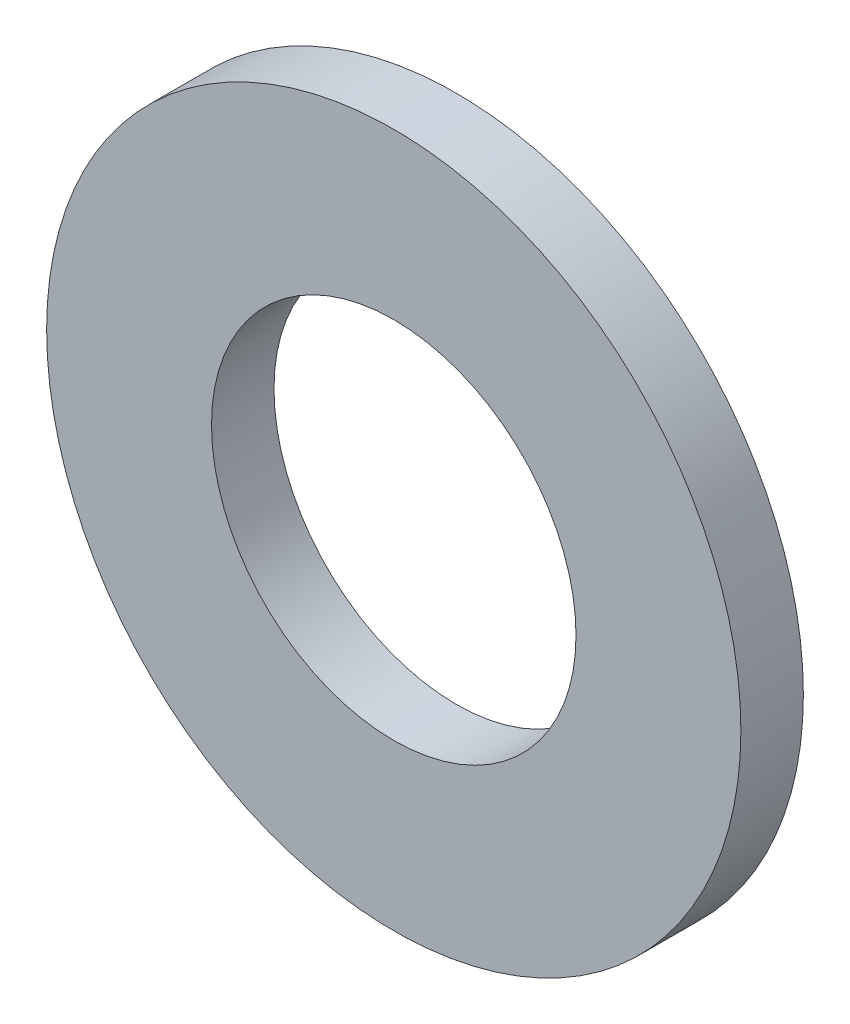
ISO-10303-21;
HEADER;
FILE_DESCRIPTION(('STEP AP214'),'2;1');
FILE_NAME('part.step','',(''),(''),'','','');
FILE_SCHEMA(('AUTOMOTIVE_DESIGN { 1 0 10303 214 1 1 1 1 }'));
ENDSEC;
DATA;
#1=APPLICATION_CONTEXT('core data for automotive mechanical design processes');
#2=APPLICATION_PROTOCOL_DEFINITION('international standard','automotive_design',2000,#1);
#3=PRODUCT_CONTEXT('',#1,'mechanical');
#4=PRODUCT('Part','Part','',(#3));
#5=PRODUCT_RELATED_PRODUCT_CATEGORY('part','',(#4));
#6=PRODUCT_DEFINITION_FORMATION('','',#4);
#7=PRODUCT_DEFINITION_CONTEXT('part definition',#1,'design');
#8=PRODUCT_DEFINITION('design','',#6,#7);
#9=PRODUCT_DEFINITION_SHAPE('','',#8);
#10=(LENGTH_UNIT() NAMED_UNIT(*) SI_UNIT(.MILLI.,.METRE.));
#11=(NAMED_UNIT(*) PLANE_ANGLE_UNIT() SI_UNIT($,.RADIAN.));
#12=(NAMED_UNIT(*) SI_UNIT($,.STERADIAN.) SOLID_ANGLE_UNIT());
#13=UNCERTAINTY_MEASURE_WITH_UNIT(LENGTH_MEASURE(1.E-05),#10,'distance_accuracy_value','');
#14=(GEOMETRIC_REPRESENTATION_CONTEXT(3) GLOBAL_UNCERTAINTY_ASSIGNED_CONTEXT((#13)) GLOBAL_UNIT_ASSIGNED_CONTEXT((#10,
#11,#12)) REPRESENTATION_CONTEXT('',''));
#15=CARTESIAN_POINT('',(0.,0.,0.));
#16=DIRECTION('',(0.,0.,1.));
#17=DIRECTION('',(1.,0.,0.));
#18=AXIS2_PLACEMENT_3D('',#15,#16,#17);
#19=CARTESIAN_POINT('',(0.,0.,-1.8));
#20=DIRECTION('',(0.,0.,1.));
#21=DIRECTION('',(1.,0.,0.));
#22=AXIS2_PLACEMENT_3D('',#19,#20,#21);
#23=CYLINDRICAL_SURFACE('',#22,10.);
#24=CARTESIAN_POINT('',(0.,0.,-1.8));
#25=DIRECTION('',(0.,0.,1.));
#26=DIRECTION('',(1.,0.,0.));
#27=AXIS2_PLACEMENT_3D('',#24,#25,#26);
#28=CIRCLE('',#27,10.);
#29=CARTESIAN_POINT('',(10.,0.,-1.8));
#30=VERTEX_POINT('',#29);
#31=EDGE_CURVE('E10',#30,#30,#28,.T.);
#32=ORIENTED_EDGE('',*,*,#31,.T.);
#33=EDGE_LOOP('',(#32));
#34=FACE_BOUND('',#33,.T.);
#35=CARTESIAN_POINT('',(0.,0.,0.));
#36=DIRECTION('',(0.,0.,1.));
#37=DIRECTION('',(1.,0.,0.));
#38=AXIS2_PLACEMENT_3D('',#35,#36,#37);
#39=CIRCLE('',#38,10.);
#40=CARTESIAN_POINT('',(10.,0.,0.));
#41=VERTEX_POINT('',#40);
#42=EDGE_CURVE('E32',#41,#41,#39,.T.);
#43=ORIENTED_EDGE('',*,*,#42,.F.);
#44=EDGE_LOOP('',(#43));
#45=FACE_BOUND('',#44,.T.);
#46=ADVANCED_FACE('F29',(#34,#45),#23,.T.);
#47=CARTESIAN_POINT('',(0.,0.,-1.8));
#48=DIRECTION('',(0.,0.,1.));
#49=DIRECTION('',(1.,0.,0.));
#50=AXIS2_PLACEMENT_3D('',#47,#48,#49);
#51=PLANE('',#50);
#52=CARTESIAN_POINT('',(0.,0.,-1.8));
#53=DIRECTION('',(0.,0.,1.));
#54=DIRECTION('',(1.,0.,0.));
#55=AXIS2_PLACEMENT_3D('',#52,#53,#54);
#56=CIRCLE('',#55,5.25);
#57=CARTESIAN_POINT('',(5.25,0.,-1.8));
#58=VERTEX_POINT('',#57);
#59=EDGE_CURVE('E39',#58,#58,#56,.T.);
#60=ORIENTED_EDGE('',*,*,#59,.T.);
#61=EDGE_LOOP('',(#60));
#62=FACE_BOUND('',#61,.T.);
#63=ORIENTED_EDGE('',*,*,#31,.F.);
#64=EDGE_LOOP('',(#63));
#65=FACE_BOUND('',#64,.T.);
#66=ADVANCED_FACE('F47',(#62,#65),#51,.F.);
#67=CARTESIAN_POINT('',(0.,0.,0.));
#68=DIRECTION('',(0.,0.,1.));
#69=DIRECTION('',(1.,0.,0.));
#70=AXIS2_PLACEMENT_3D('',#67,#68,#69);
#71=PLANE('',#70);
#72=CARTESIAN_POINT('',(0.,0.,0.));
#73=DIRECTION('',(0.,0.,1.));
#74=DIRECTION('',(1.,0.,0.));
#75=AXIS2_PLACEMENT_3D('',#72,#73,#74);
#76=CIRCLE('',#75,5.25);
#77=CARTESIAN_POINT('',(5.25,0.,0.));
#78=VERTEX_POINT('',#77);
#79=EDGE_CURVE('E41',#78,#78,#76,.T.);
#80=ORIENTED_EDGE('',*,*,#79,.F.);
#81=EDGE_LOOP('',(#80));
#82=FACE_BOUND('',#81,.T.);
#83=ORIENTED_EDGE('',*,*,#42,.T.);
#84=EDGE_LOOP('',(#83));
#85=FACE_BOUND('',#84,.T.);
#86=ADVANCED_FACE('F53',(#82,#85),#71,.T.);
#87=CARTESIAN_POINT('',(0.,0.,-1.8));
#88=DIRECTION('',(0.,0.,1.));
#89=DIRECTION('',(1.,0.,0.));
#90=AXIS2_PLACEMENT_3D('',#87,#88,#89);
#91=CYLINDRICAL_SURFACE('',#90,5.25);
#92=ORIENTED_EDGE('',*,*,#59,.F.);
#93=EDGE_LOOP('',(#92));
#94=FACE_BOUND('',#93,.T.);
#95=ORIENTED_EDGE('',*,*,#79,.T.);
#96=EDGE_LOOP('',(#95));
#97=FACE_BOUND('',#96,.T.);
#98=ADVANCED_FACE('F50',(#94,#97),#91,.F.);
#99=CLOSED_SHELL('',(#46,#66,#86,#98));
#100=MANIFOLD_SOLID_BREP('B2',#99);
#101=ADVANCED_BREP_SHAPE_REPRESENTATION('',(#18,#100),#14);
#102=SHAPE_DEFINITION_REPRESENTATION(#9,#101);
ENDSEC;
END-ISO-10303-21;
